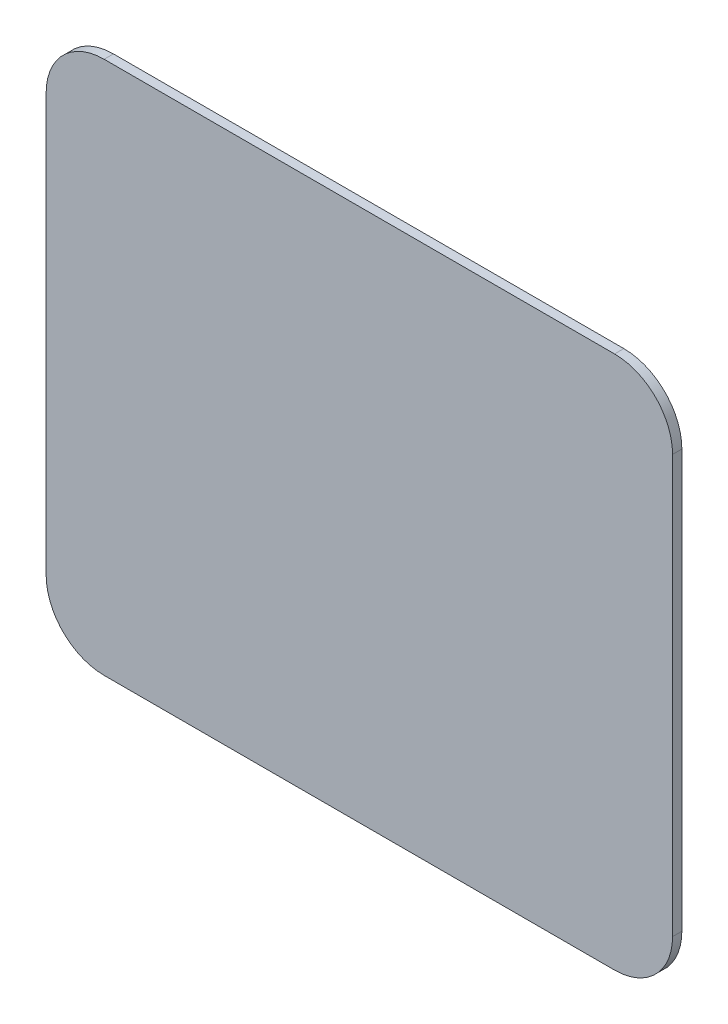
ISO-10303-21;
HEADER;
FILE_DESCRIPTION(('STEP AP214'),'2;1');
FILE_NAME('part.step','',(''),(''),'','','');
FILE_SCHEMA(('AUTOMOTIVE_DESIGN { 1 0 10303 214 1 1 1 1 }'));
ENDSEC;
DATA;
#1=APPLICATION_CONTEXT('core data for automotive mechanical design processes');
#2=APPLICATION_PROTOCOL_DEFINITION('international standard','automotive_design',2000,#1);
#3=PRODUCT_CONTEXT('',#1,'mechanical');
#4=PRODUCT('Part','Part','',(#3));
#5=PRODUCT_RELATED_PRODUCT_CATEGORY('part','',(#4));
#6=PRODUCT_DEFINITION_FORMATION('','',#4);
#7=PRODUCT_DEFINITION_CONTEXT('part definition',#1,'design');
#8=PRODUCT_DEFINITION('design','',#6,#7);
#9=PRODUCT_DEFINITION_SHAPE('','',#8);
#10=(LENGTH_UNIT() NAMED_UNIT(*) SI_UNIT(.MILLI.,.METRE.));
#11=(NAMED_UNIT(*) PLANE_ANGLE_UNIT() SI_UNIT($,.RADIAN.));
#12=(NAMED_UNIT(*) SI_UNIT($,.STERADIAN.) SOLID_ANGLE_UNIT());
#13=UNCERTAINTY_MEASURE_WITH_UNIT(LENGTH_MEASURE(1.E-05),#10,'distance_accuracy_value','');
#14=(GEOMETRIC_REPRESENTATION_CONTEXT(3) GLOBAL_UNCERTAINTY_ASSIGNED_CONTEXT((#13)) GLOBAL_UNIT_ASSIGNED_CONTEXT((#10,
#11,#12)) REPRESENTATION_CONTEXT('',''));
#15=CARTESIAN_POINT('',(0.,0.,0.));
#16=DIRECTION('',(0.,0.,1.));
#17=DIRECTION('',(1.,0.,0.));
#18=AXIS2_PLACEMENT_3D('',#15,#16,#17);
#19=CARTESIAN_POINT('',(-1.1,1.15,1.099999999106));
#20=DIRECTION('',(0.,0.,1.));
#21=DIRECTION('',(1.,0.,0.));
#22=AXIS2_PLACEMENT_3D('',#19,#20,#21);
#23=PLANE('',#22);
#24=DIRECTION('',(1.,0.,0.));
#25=VECTOR('',#24,1.);
#26=CARTESIAN_POINT('',(1.1,-1.15,1.099999999106));
#27=LINE('',#26,#25);
#28=CARTESIAN_POINT('',(1.1,-1.15,1.099999999106));
#29=VERTEX_POINT('',#28);
#30=CARTESIAN_POINT('',(-1.1,-1.15,1.099999999106));
#31=VERTEX_POINT('',#30);
#32=EDGE_CURVE('E106',#29,#31,#27,.F.);
#33=ORIENTED_EDGE('',*,*,#32,.F.);
#34=CARTESIAN_POINT('',(1.1,-0.9,1.099999999106));
#35=DIRECTION('',(0.,0.,-1.));
#36=DIRECTION('',(-1.,0.,0.));
#37=AXIS2_PLACEMENT_3D('',#34,#35,#36);
#38=CIRCLE('',#37,0.25);
#39=CARTESIAN_POINT('',(1.35,-0.9,1.099999999106));
#40=VERTEX_POINT('',#39);
#41=EDGE_CURVE('E109',#40,#29,#38,.T.);
#42=ORIENTED_EDGE('',*,*,#41,.F.);
#43=DIRECTION('',(0.,1.,0.));
#44=VECTOR('',#43,1.);
#45=CARTESIAN_POINT('',(1.35,0.9,1.099999999106));
#46=LINE('',#45,#44);
#47=CARTESIAN_POINT('',(1.35,0.9,1.099999999106));
#48=VERTEX_POINT('',#47);
#49=EDGE_CURVE('E84',#48,#40,#46,.F.);
#50=ORIENTED_EDGE('',*,*,#49,.F.);
#51=CARTESIAN_POINT('',(1.1,0.9,1.099999999106));
#52=DIRECTION('',(0.,0.,-1.));
#53=DIRECTION('',(-1.,0.,0.));
#54=AXIS2_PLACEMENT_3D('',#51,#52,#53);
#55=CIRCLE('',#54,0.25);
#56=CARTESIAN_POINT('',(1.1,1.15,1.099999999106));
#57=VERTEX_POINT('',#56);
#58=EDGE_CURVE('E20',#57,#48,#55,.T.);
#59=ORIENTED_EDGE('',*,*,#58,.F.);
#60=DIRECTION('',(1.,0.,0.));
#61=VECTOR('',#60,1.);
#62=CARTESIAN_POINT('',(-1.1,1.15,1.099999999106));
#63=LINE('',#62,#61);
#64=CARTESIAN_POINT('',(-1.1,1.15,1.099999999106));
#65=VERTEX_POINT('',#64);
#66=EDGE_CURVE('E82',#65,#57,#63,.T.);
#67=ORIENTED_EDGE('',*,*,#66,.F.);
#68=CARTESIAN_POINT('',(-1.1,0.9,1.099999999106));
#69=DIRECTION('',(0.,0.,-1.));
#70=DIRECTION('',(-1.,0.,0.));
#71=AXIS2_PLACEMENT_3D('',#68,#69,#70);
#72=CIRCLE('',#71,0.25);
#73=CARTESIAN_POINT('',(-1.35,0.9,1.099999999106));
#74=VERTEX_POINT('',#73);
#75=EDGE_CURVE('E95',#74,#65,#72,.T.);
#76=ORIENTED_EDGE('',*,*,#75,.F.);
#77=DIRECTION('',(0.,1.,0.));
#78=VECTOR('',#77,1.);
#79=CARTESIAN_POINT('',(-1.35,-0.9,1.099999999106));
#80=LINE('',#79,#78);
#81=CARTESIAN_POINT('',(-1.35,-0.9,1.099999999106));
#82=VERTEX_POINT('',#81);
#83=EDGE_CURVE('E111',#82,#74,#80,.T.);
#84=ORIENTED_EDGE('',*,*,#83,.F.);
#85=CARTESIAN_POINT('',(-1.1,-0.9,1.099999999106));
#86=DIRECTION('',(0.,0.,-1.));
#87=DIRECTION('',(-1.,0.,0.));
#88=AXIS2_PLACEMENT_3D('',#85,#86,#87);
#89=CIRCLE('',#88,0.25);
#90=EDGE_CURVE('E113',#31,#82,#89,.T.);
#91=ORIENTED_EDGE('',*,*,#90,.F.);
#92=EDGE_LOOP('',(#33,#42,#50,#59,#67,#76,#84,#91));
#93=FACE_BOUND('',#92,.T.);
#94=ADVANCED_FACE('F17',(#93),#23,.T.);
#95=CARTESIAN_POINT('',(1.1,0.9,1.06));
#96=DIRECTION('',(0.,0.,-1.));
#97=DIRECTION('',(-1.,0.,0.));
#98=AXIS2_PLACEMENT_3D('',#95,#96,#97);
#99=CYLINDRICAL_SURFACE('',#98,0.25);
#100=CARTESIAN_POINT('',(1.1,0.9,1.06));
#101=DIRECTION('',(0.,0.,-1.));
#102=DIRECTION('',(-1.,0.,0.));
#103=AXIS2_PLACEMENT_3D('',#100,#101,#102);
#104=CIRCLE('',#103,0.25);
#105=CARTESIAN_POINT('',(1.35,0.9,1.06));
#106=VERTEX_POINT('',#105);
#107=CARTESIAN_POINT('',(1.1,1.15,1.06));
#108=VERTEX_POINT('',#107);
#109=EDGE_CURVE('E99',#106,#108,#104,.F.);
#110=ORIENTED_EDGE('',*,*,#109,.T.);
#111=DIRECTION('',(0.,0.,1.));
#112=VECTOR('',#111,1.);
#113=CARTESIAN_POINT('',(1.1,1.15,1.06));
#114=LINE('',#113,#112);
#115=EDGE_CURVE('E89',#57,#108,#114,.F.);
#116=ORIENTED_EDGE('',*,*,#115,.F.);
#117=ORIENTED_EDGE('',*,*,#58,.T.);
#118=DIRECTION('',(0.,0.,-1.));
#119=VECTOR('',#118,1.);
#120=CARTESIAN_POINT('',(1.35,0.9,1.06));
#121=LINE('',#120,#119);
#122=EDGE_CURVE('E105',#106,#48,#121,.F.);
#123=ORIENTED_EDGE('',*,*,#122,.F.);
#124=EDGE_LOOP('',(#110,#116,#117,#123));
#125=FACE_BOUND('',#124,.T.);
#126=ADVANCED_FACE('F98',(#125),#99,.T.);
#127=CARTESIAN_POINT('',(-1.1,1.15,1.06));
#128=DIRECTION('',(0.,1.,0.));
#129=DIRECTION('',(0.,0.,1.));
#130=AXIS2_PLACEMENT_3D('',#127,#128,#129);
#131=PLANE('',#130);
#132=DIRECTION('',(0.,0.,-1.));
#133=VECTOR('',#132,1.);
#134=CARTESIAN_POINT('',(-1.1,1.15,1.06));
#135=LINE('',#134,#133);
#136=CARTESIAN_POINT('',(-1.1,1.15,1.06));
#137=VERTEX_POINT('',#136);
#138=EDGE_CURVE('E94',#65,#137,#135,.T.);
#139=ORIENTED_EDGE('',*,*,#138,.F.);
#140=ORIENTED_EDGE('',*,*,#66,.T.);
#141=ORIENTED_EDGE('',*,*,#115,.T.);
#142=DIRECTION('',(1.,0.,0.));
#143=VECTOR('',#142,1.);
#144=CARTESIAN_POINT('',(-1.1,1.15,1.06));
#145=LINE('',#144,#143);
#146=EDGE_CURVE('E126',#108,#137,#145,.F.);
#147=ORIENTED_EDGE('',*,*,#146,.T.);
#148=EDGE_LOOP('',(#139,#140,#141,#147));
#149=FACE_BOUND('',#148,.T.);
#150=ADVANCED_FACE('F91',(#149),#131,.T.);
#151=CARTESIAN_POINT('',(-1.1,0.9,1.06));
#152=DIRECTION('',(0.,0.,-1.));
#153=DIRECTION('',(-1.,0.,0.));
#154=AXIS2_PLACEMENT_3D('',#151,#152,#153);
#155=CYLINDRICAL_SURFACE('',#154,0.25);
#156=CARTESIAN_POINT('',(-1.1,0.9,1.06));
#157=DIRECTION('',(0.,0.,-1.));
#158=DIRECTION('',(-1.,0.,0.));
#159=AXIS2_PLACEMENT_3D('',#156,#157,#158);
#160=CIRCLE('',#159,0.25);
#161=CARTESIAN_POINT('',(-1.35,0.9,1.06));
#162=VERTEX_POINT('',#161);
#163=EDGE_CURVE('E123',#137,#162,#160,.F.);
#164=ORIENTED_EDGE('',*,*,#163,.T.);
#165=DIRECTION('',(0.,0.,1.));
#166=VECTOR('',#165,1.);
#167=CARTESIAN_POINT('',(-1.35,0.9,1.06));
#168=LINE('',#167,#166);
#169=EDGE_CURVE('E114',#74,#162,#168,.F.);
#170=ORIENTED_EDGE('',*,*,#169,.F.);
#171=ORIENTED_EDGE('',*,*,#75,.T.);
#172=ORIENTED_EDGE('',*,*,#138,.T.);
#173=EDGE_LOOP('',(#164,#170,#171,#172));
#174=FACE_BOUND('',#173,.T.);
#175=ADVANCED_FACE('F160',(#174),#155,.T.);
#176=CARTESIAN_POINT('',(-1.35,-0.9,1.06));
#177=DIRECTION('',(-1.,0.,0.));
#178=DIRECTION('',(0.,0.,1.));
#179=AXIS2_PLACEMENT_3D('',#176,#177,#178);
#180=PLANE('',#179);
#181=DIRECTION('',(0.,0.,-1.));
#182=VECTOR('',#181,1.);
#183=CARTESIAN_POINT('',(-1.35,-0.9,1.06));
#184=LINE('',#183,#182);
#185=CARTESIAN_POINT('',(-1.35,-0.9,1.06));
#186=VERTEX_POINT('',#185);
#187=EDGE_CURVE('E130',#82,#186,#184,.T.);
#188=ORIENTED_EDGE('',*,*,#187,.F.);
#189=ORIENTED_EDGE('',*,*,#83,.T.);
#190=ORIENTED_EDGE('',*,*,#169,.T.);
#191=DIRECTION('',(0.,1.,0.));
#192=VECTOR('',#191,1.);
#193=CARTESIAN_POINT('',(-1.35,1.15,1.06));
#194=LINE('',#193,#192);
#195=EDGE_CURVE('E122',#162,#186,#194,.F.);
#196=ORIENTED_EDGE('',*,*,#195,.T.);
#197=EDGE_LOOP('',(#188,#189,#190,#196));
#198=FACE_BOUND('',#197,.T.);
#199=ADVANCED_FACE('F159',(#198),#180,.T.);
#200=CARTESIAN_POINT('',(-1.1,-0.9,1.06));
#201=DIRECTION('',(0.,0.,-1.));
#202=DIRECTION('',(-1.,0.,0.));
#203=AXIS2_PLACEMENT_3D('',#200,#201,#202);
#204=CYLINDRICAL_SURFACE('',#203,0.25);
#205=CARTESIAN_POINT('',(-1.1,-0.9,1.06));
#206=DIRECTION('',(0.,0.,-1.));
#207=DIRECTION('',(-1.,0.,0.));
#208=AXIS2_PLACEMENT_3D('',#205,#206,#207);
#209=CIRCLE('',#208,0.25);
#210=CARTESIAN_POINT('',(-1.1,-1.15,1.06));
#211=VERTEX_POINT('',#210);
#212=EDGE_CURVE('E119',#186,#211,#209,.F.);
#213=ORIENTED_EDGE('',*,*,#212,.T.);
#214=DIRECTION('',(0.,0.,-1.));
#215=VECTOR('',#214,1.);
#216=CARTESIAN_POINT('',(-1.1,-1.15,1.06));
#217=LINE('',#216,#215);
#218=EDGE_CURVE('E110',#31,#211,#217,.T.);
#219=ORIENTED_EDGE('',*,*,#218,.F.);
#220=ORIENTED_EDGE('',*,*,#90,.T.);
#221=ORIENTED_EDGE('',*,*,#187,.T.);
#222=EDGE_LOOP('',(#213,#219,#220,#221));
#223=FACE_BOUND('',#222,.T.);
#224=ADVANCED_FACE('F156',(#223),#204,.T.);
#225=CARTESIAN_POINT('',(1.1,-1.15,1.06));
#226=DIRECTION('',(0.,-1.,0.));
#227=DIRECTION('',(0.,0.,-1.));
#228=AXIS2_PLACEMENT_3D('',#225,#226,#227);
#229=PLANE('',#228);
#230=DIRECTION('',(0.,0.,-1.));
#231=VECTOR('',#230,1.);
#232=CARTESIAN_POINT('',(1.1,-1.15,1.06));
#233=LINE('',#232,#231);
#234=CARTESIAN_POINT('',(1.1,-1.15,1.06));
#235=VERTEX_POINT('',#234);
#236=EDGE_CURVE('E129',#29,#235,#233,.T.);
#237=ORIENTED_EDGE('',*,*,#236,.F.);
#238=ORIENTED_EDGE('',*,*,#32,.T.);
#239=ORIENTED_EDGE('',*,*,#218,.T.);
#240=DIRECTION('',(1.,0.,0.));
#241=VECTOR('',#240,1.);
#242=CARTESIAN_POINT('',(-1.1,-1.15,1.06));
#243=LINE('',#242,#241);
#244=EDGE_CURVE('E118',#211,#235,#243,.T.);
#245=ORIENTED_EDGE('',*,*,#244,.T.);
#246=EDGE_LOOP('',(#237,#238,#239,#245));
#247=FACE_BOUND('',#246,.T.);
#248=ADVANCED_FACE('F149',(#247),#229,.T.);
#249=CARTESIAN_POINT('',(1.1,-0.9,1.06));
#250=DIRECTION('',(0.,0.,-1.));
#251=DIRECTION('',(-1.,0.,0.));
#252=AXIS2_PLACEMENT_3D('',#249,#250,#251);
#253=CYLINDRICAL_SURFACE('',#252,0.25);
#254=CARTESIAN_POINT('',(1.1,-0.9,1.06));
#255=DIRECTION('',(0.,0.,-1.));
#256=DIRECTION('',(-1.,0.,0.));
#257=AXIS2_PLACEMENT_3D('',#254,#255,#256);
#258=CIRCLE('',#257,0.25);
#259=CARTESIAN_POINT('',(1.35,-0.9,1.06));
#260=VERTEX_POINT('',#259);
#261=EDGE_CURVE('E26',#235,#260,#258,.F.);
#262=ORIENTED_EDGE('',*,*,#261,.T.);
#263=DIRECTION('',(0.,0.,-1.));
#264=VECTOR('',#263,1.);
#265=CARTESIAN_POINT('',(1.35,-0.9,1.06));
#266=LINE('',#265,#264);
#267=EDGE_CURVE('E34',#40,#260,#266,.T.);
#268=ORIENTED_EDGE('',*,*,#267,.F.);
#269=ORIENTED_EDGE('',*,*,#41,.T.);
#270=ORIENTED_EDGE('',*,*,#236,.T.);
#271=EDGE_LOOP('',(#262,#268,#269,#270));
#272=FACE_BOUND('',#271,.T.);
#273=ADVANCED_FACE('F176',(#272),#253,.T.);
#274=CARTESIAN_POINT('',(1.35,0.9,1.06));
#275=DIRECTION('',(1.,0.,0.));
#276=DIRECTION('',(0.,0.,-1.));
#277=AXIS2_PLACEMENT_3D('',#274,#275,#276);
#278=PLANE('',#277);
#279=ORIENTED_EDGE('',*,*,#122,.T.);
#280=ORIENTED_EDGE('',*,*,#49,.T.);
#281=ORIENTED_EDGE('',*,*,#267,.T.);
#282=DIRECTION('',(0.,1.,0.));
#283=VECTOR('',#282,1.);
#284=CARTESIAN_POINT('',(1.35,1.15,1.06));
#285=LINE('',#284,#283);
#286=EDGE_CURVE('E11',#260,#106,#285,.T.);
#287=ORIENTED_EDGE('',*,*,#286,.T.);
#288=EDGE_LOOP('',(#279,#280,#281,#287));
#289=FACE_BOUND('',#288,.T.);
#290=ADVANCED_FACE('F171',(#289),#278,.T.);
#291=CARTESIAN_POINT('',(-1.1,1.15,1.06));
#292=DIRECTION('',(0.,0.,1.));
#293=DIRECTION('',(1.,0.,0.));
#294=AXIS2_PLACEMENT_3D('',#291,#292,#293);
#295=PLANE('',#294);
#296=ORIENTED_EDGE('',*,*,#261,.F.);
#297=ORIENTED_EDGE('',*,*,#244,.F.);
#298=ORIENTED_EDGE('',*,*,#212,.F.);
#299=ORIENTED_EDGE('',*,*,#195,.F.);
#300=ORIENTED_EDGE('',*,*,#163,.F.);
#301=ORIENTED_EDGE('',*,*,#146,.F.);
#302=ORIENTED_EDGE('',*,*,#109,.F.);
#303=ORIENTED_EDGE('',*,*,#286,.F.);
#304=EDGE_LOOP('',(#296,#297,#298,#299,#300,#301,#302,#303));
#305=FACE_BOUND('',#304,.T.);
#306=ADVANCED_FACE('F154',(#305),#295,.F.);
#307=CLOSED_SHELL('',(#94,#126,#150,#175,#199,#224,#248,#273,#290,#306));
#308=MANIFOLD_SOLID_BREP('B1',#307);
#309=ADVANCED_BREP_SHAPE_REPRESENTATION('',(#18,#308),#14);
#310=SHAPE_DEFINITION_REPRESENTATION(#9,#309);
ENDSEC;
END-ISO-10303-21;
